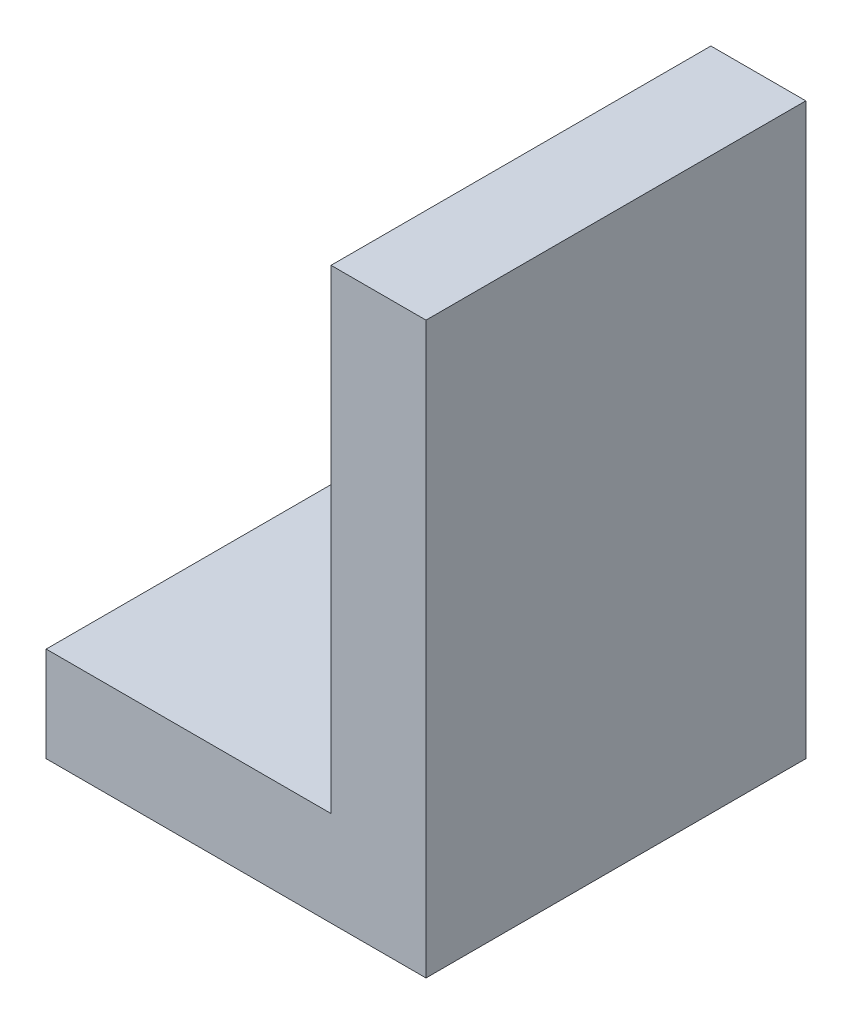
ISO-10303-21;
HEADER;
FILE_DESCRIPTION(('STEP AP214'),'2;1');
FILE_NAME('part.step','',(''),(''),'','','');
FILE_SCHEMA(('AUTOMOTIVE_DESIGN { 1 0 10303 214 1 1 1 1 }'));
ENDSEC;
DATA;
#1=APPLICATION_CONTEXT('core data for automotive mechanical design processes');
#2=APPLICATION_PROTOCOL_DEFINITION('international standard','automotive_design',2000,#1);
#3=PRODUCT_CONTEXT('',#1,'mechanical');
#4=PRODUCT('Part','Part','',(#3));
#5=PRODUCT_RELATED_PRODUCT_CATEGORY('part','',(#4));
#6=PRODUCT_DEFINITION_FORMATION('','',#4);
#7=PRODUCT_DEFINITION_CONTEXT('part definition',#1,'design');
#8=PRODUCT_DEFINITION('design','',#6,#7);
#9=PRODUCT_DEFINITION_SHAPE('','',#8);
#10=(LENGTH_UNIT() NAMED_UNIT(*) SI_UNIT(.MILLI.,.METRE.));
#11=(NAMED_UNIT(*) PLANE_ANGLE_UNIT() SI_UNIT($,.RADIAN.));
#12=(NAMED_UNIT(*) SI_UNIT($,.STERADIAN.) SOLID_ANGLE_UNIT());
#13=UNCERTAINTY_MEASURE_WITH_UNIT(LENGTH_MEASURE(1.E-05),#10,'distance_accuracy_value','');
#14=(GEOMETRIC_REPRESENTATION_CONTEXT(3) GLOBAL_UNCERTAINTY_ASSIGNED_CONTEXT((#13)) GLOBAL_UNIT_ASSIGNED_CONTEXT((#10,
#11,#12)) REPRESENTATION_CONTEXT('',''));
#15=CARTESIAN_POINT('',(0.,0.,0.));
#16=DIRECTION('',(0.,0.,1.));
#17=DIRECTION('',(1.,0.,0.));
#18=AXIS2_PLACEMENT_3D('',#15,#16,#17);
#19=CARTESIAN_POINT('',(0.,10.,0.));
#20=DIRECTION('',(0.,-1.,0.));
#21=DIRECTION('',(0.,0.,-1.));
#22=AXIS2_PLACEMENT_3D('',#19,#20,#21);
#23=PLANE('',#22);
#24=DIRECTION('',(0.,0.,1.));
#25=VECTOR('',#24,1.);
#26=CARTESIAN_POINT('',(-1.64556962025316,10.,-5.72151898734177));
#27=LINE('',#26,#25);
#28=CARTESIAN_POINT('',(-1.64556962025316,10.,-5.72151898734177));
#29=VERTEX_POINT('',#28);
#30=CARTESIAN_POINT('',(-1.64556962025316,10.,34.2784810126582));
#31=VERTEX_POINT('',#30);
#32=EDGE_CURVE('E52',#29,#31,#27,.T.);
#33=ORIENTED_EDGE('',*,*,#32,.F.);
#34=DIRECTION('',(-1.,0.,0.));
#35=VECTOR('',#34,1.);
#36=CARTESIAN_POINT('',(8.35443037974684,10.,-5.72151898734177));
#37=LINE('',#36,#35);
#38=CARTESIAN_POINT('',(-31.6455696202532,10.,-5.72151898734177));
#39=VERTEX_POINT('',#38);
#40=EDGE_CURVE('E89',#29,#39,#37,.T.);
#41=ORIENTED_EDGE('',*,*,#40,.T.);
#42=DIRECTION('',(0.,0.,1.));
#43=VECTOR('',#42,1.);
#44=CARTESIAN_POINT('',(-31.6455696202532,10.,-5.72151898734177));
#45=LINE('',#44,#43);
#46=CARTESIAN_POINT('',(-31.6455696202532,10.,34.2784810126582));
#47=VERTEX_POINT('',#46);
#48=EDGE_CURVE('E58',#39,#47,#45,.T.);
#49=ORIENTED_EDGE('',*,*,#48,.T.);
#50=DIRECTION('',(1.,0.,0.));
#51=VECTOR('',#50,1.);
#52=CARTESIAN_POINT('',(8.35443037974684,10.,34.2784810126582));
#53=LINE('',#52,#51);
#54=EDGE_CURVE('E99',#47,#31,#53,.T.);
#55=ORIENTED_EDGE('',*,*,#54,.T.);
#56=EDGE_LOOP('',(#33,#41,#49,#55));
#57=FACE_BOUND('',#56,.T.);
#58=ADVANCED_FACE('F37',(#57),#23,.F.);
#59=CARTESIAN_POINT('',(8.35443037974684,10.,-5.72151898734177));
#60=DIRECTION('',(-1.,0.,0.));
#61=DIRECTION('',(0.,0.,1.));
#62=AXIS2_PLACEMENT_3D('',#59,#60,#61);
#63=PLANE('',#62);
#64=DIRECTION('',(0.,0.,-1.));
#65=VECTOR('',#64,1.);
#66=CARTESIAN_POINT('',(8.35443037974684,0.,-5.72151898734177));
#67=LINE('',#66,#65);
#68=CARTESIAN_POINT('',(8.35443037974684,0.,34.2784810126582));
#69=VERTEX_POINT('',#68);
#70=CARTESIAN_POINT('',(8.35443037974684,0.,-5.72151898734177));
#71=VERTEX_POINT('',#70);
#72=EDGE_CURVE('E96',#69,#71,#67,.T.);
#73=ORIENTED_EDGE('',*,*,#72,.T.);
#74=DIRECTION('',(0.,-1.,0.));
#75=VECTOR('',#74,1.);
#76=CARTESIAN_POINT('',(8.35443037974684,10.,-5.72151898734177));
#77=LINE('',#76,#75);
#78=CARTESIAN_POINT('',(8.35443037974684,60.,-5.72151898734177));
#79=VERTEX_POINT('',#78);
#80=EDGE_CURVE('E11',#79,#71,#77,.T.);
#81=ORIENTED_EDGE('',*,*,#80,.F.);
#82=DIRECTION('',(0.,0.,-1.));
#83=VECTOR('',#82,1.);
#84=CARTESIAN_POINT('',(8.35443037974684,60.,-5.72151898734177));
#85=LINE('',#84,#83);
#86=CARTESIAN_POINT('',(8.35443037974684,60.,34.2784810126582));
#87=VERTEX_POINT('',#86);
#88=EDGE_CURVE('E98',#87,#79,#85,.T.);
#89=ORIENTED_EDGE('',*,*,#88,.F.);
#90=DIRECTION('',(0.,-1.,0.));
#91=VECTOR('',#90,1.);
#92=CARTESIAN_POINT('',(8.35443037974684,10.,34.2784810126582));
#93=LINE('',#92,#91);
#94=EDGE_CURVE('E82',#87,#69,#93,.T.);
#95=ORIENTED_EDGE('',*,*,#94,.T.);
#96=EDGE_LOOP('',(#73,#81,#89,#95));
#97=FACE_BOUND('',#96,.T.);
#98=ADVANCED_FACE('F39',(#97),#63,.F.);
#99=CARTESIAN_POINT('',(8.35443037974684,10.,-5.72151898734177));
#100=DIRECTION('',(0.,0.,1.));
#101=DIRECTION('',(1.,0.,0.));
#102=AXIS2_PLACEMENT_3D('',#99,#100,#101);
#103=PLANE('',#102);
#104=DIRECTION('',(-1.,0.,0.));
#105=VECTOR('',#104,1.);
#106=CARTESIAN_POINT('',(8.35443037974684,0.,-5.72151898734177));
#107=LINE('',#106,#105);
#108=CARTESIAN_POINT('',(-31.6455696202532,0.,-5.72151898734177));
#109=VERTEX_POINT('',#108);
#110=EDGE_CURVE('E102',#71,#109,#107,.T.);
#111=ORIENTED_EDGE('',*,*,#110,.T.);
#112=DIRECTION('',(0.,-1.,0.));
#113=VECTOR('',#112,1.);
#114=CARTESIAN_POINT('',(-31.6455696202532,10.,-5.72151898734177));
#115=LINE('',#114,#113);
#116=EDGE_CURVE('E45',#39,#109,#115,.T.);
#117=ORIENTED_EDGE('',*,*,#116,.F.);
#118=ORIENTED_EDGE('',*,*,#40,.F.);
#119=DIRECTION('',(0.,-1.,0.));
#120=VECTOR('',#119,1.);
#121=CARTESIAN_POINT('',(-1.64556962025316,60.,-5.72151898734177));
#122=LINE('',#121,#120);
#123=CARTESIAN_POINT('',(-1.64556962025316,60.,-5.72151898734177));
#124=VERTEX_POINT('',#123);
#125=EDGE_CURVE('E103',#124,#29,#122,.T.);
#126=ORIENTED_EDGE('',*,*,#125,.F.);
#127=DIRECTION('',(-1.,0.,0.));
#128=VECTOR('',#127,1.);
#129=CARTESIAN_POINT('',(8.35443037974684,60.,-5.72151898734177));
#130=LINE('',#129,#128);
#131=EDGE_CURVE('E123',#79,#124,#130,.T.);
#132=ORIENTED_EDGE('',*,*,#131,.F.);
#133=ORIENTED_EDGE('',*,*,#80,.T.);
#134=EDGE_LOOP('',(#111,#117,#118,#126,#132,#133));
#135=FACE_BOUND('',#134,.T.);
#136=ADVANCED_FACE('F118',(#135),#103,.F.);
#137=CARTESIAN_POINT('',(-31.6455696202532,10.,-5.72151898734177));
#138=DIRECTION('',(1.,0.,0.));
#139=DIRECTION('',(0.,0.,-1.));
#140=AXIS2_PLACEMENT_3D('',#137,#138,#139);
#141=PLANE('',#140);
#142=DIRECTION('',(0.,0.,1.));
#143=VECTOR('',#142,1.);
#144=CARTESIAN_POINT('',(-31.6455696202532,0.,-5.72151898734177));
#145=LINE('',#144,#143);
#146=CARTESIAN_POINT('',(-31.6455696202532,0.,34.2784810126582));
#147=VERTEX_POINT('',#146);
#148=EDGE_CURVE('E90',#109,#147,#145,.T.);
#149=ORIENTED_EDGE('',*,*,#148,.T.);
#150=DIRECTION('',(0.,-1.,0.));
#151=VECTOR('',#150,1.);
#152=CARTESIAN_POINT('',(-31.6455696202532,10.,34.2784810126582));
#153=LINE('',#152,#151);
#154=EDGE_CURVE('E85',#47,#147,#153,.T.);
#155=ORIENTED_EDGE('',*,*,#154,.F.);
#156=ORIENTED_EDGE('',*,*,#48,.F.);
#157=ORIENTED_EDGE('',*,*,#116,.T.);
#158=EDGE_LOOP('',(#149,#155,#156,#157));
#159=FACE_BOUND('',#158,.T.);
#160=ADVANCED_FACE('F116',(#159),#141,.F.);
#161=CARTESIAN_POINT('',(8.35443037974684,10.,34.2784810126582));
#162=DIRECTION('',(0.,0.,-1.));
#163=DIRECTION('',(-1.,0.,0.));
#164=AXIS2_PLACEMENT_3D('',#161,#162,#163);
#165=PLANE('',#164);
#166=DIRECTION('',(1.,0.,0.));
#167=VECTOR('',#166,1.);
#168=CARTESIAN_POINT('',(8.35443037974684,0.,34.2784810126582));
#169=LINE('',#168,#167);
#170=EDGE_CURVE('E78',#147,#69,#169,.T.);
#171=ORIENTED_EDGE('',*,*,#170,.T.);
#172=ORIENTED_EDGE('',*,*,#94,.F.);
#173=DIRECTION('',(1.,0.,0.));
#174=VECTOR('',#173,1.);
#175=CARTESIAN_POINT('',(8.35443037974684,60.,34.2784810126582));
#176=LINE('',#175,#174);
#177=CARTESIAN_POINT('',(-1.64556962025316,60.,34.2784810126582));
#178=VERTEX_POINT('',#177);
#179=EDGE_CURVE('E137',#178,#87,#176,.T.);
#180=ORIENTED_EDGE('',*,*,#179,.F.);
#181=DIRECTION('',(0.,-1.,0.));
#182=VECTOR('',#181,1.);
#183=CARTESIAN_POINT('',(-1.64556962025316,60.,34.2784810126582));
#184=LINE('',#183,#182);
#185=EDGE_CURVE('E107',#178,#31,#184,.T.);
#186=ORIENTED_EDGE('',*,*,#185,.T.);
#187=ORIENTED_EDGE('',*,*,#54,.F.);
#188=ORIENTED_EDGE('',*,*,#154,.T.);
#189=EDGE_LOOP('',(#171,#172,#180,#186,#187,#188));
#190=FACE_BOUND('',#189,.T.);
#191=ADVANCED_FACE('F80',(#190),#165,.F.);
#192=CARTESIAN_POINT('',(0.,0.,0.));
#193=DIRECTION('',(0.,-1.,0.));
#194=DIRECTION('',(0.,0.,-1.));
#195=AXIS2_PLACEMENT_3D('',#192,#193,#194);
#196=PLANE('',#195);
#197=ORIENTED_EDGE('',*,*,#72,.F.);
#198=ORIENTED_EDGE('',*,*,#170,.F.);
#199=ORIENTED_EDGE('',*,*,#148,.F.);
#200=ORIENTED_EDGE('',*,*,#110,.F.);
#201=EDGE_LOOP('',(#197,#198,#199,#200));
#202=FACE_BOUND('',#201,.T.);
#203=ADVANCED_FACE('F101',(#202),#196,.T.);
#204=CARTESIAN_POINT('',(-1.64556962025316,60.,-5.72151898734177));
#205=DIRECTION('',(1.,0.,0.));
#206=DIRECTION('',(0.,0.,-1.));
#207=AXIS2_PLACEMENT_3D('',#204,#205,#206);
#208=PLANE('',#207);
#209=ORIENTED_EDGE('',*,*,#32,.T.);
#210=ORIENTED_EDGE('',*,*,#185,.F.);
#211=DIRECTION('',(0.,0.,1.));
#212=VECTOR('',#211,1.);
#213=CARTESIAN_POINT('',(-1.64556962025316,60.,-5.72151898734177));
#214=LINE('',#213,#212);
#215=EDGE_CURVE('E134',#124,#178,#214,.T.);
#216=ORIENTED_EDGE('',*,*,#215,.F.);
#217=ORIENTED_EDGE('',*,*,#125,.T.);
#218=EDGE_LOOP('',(#209,#210,#216,#217));
#219=FACE_BOUND('',#218,.T.);
#220=ADVANCED_FACE('F141',(#219),#208,.F.);
#221=CARTESIAN_POINT('',(0.,60.,0.));
#222=DIRECTION('',(0.,-1.,0.));
#223=DIRECTION('',(0.,0.,-1.));
#224=AXIS2_PLACEMENT_3D('',#221,#222,#223);
#225=PLANE('',#224);
#226=ORIENTED_EDGE('',*,*,#88,.T.);
#227=ORIENTED_EDGE('',*,*,#131,.T.);
#228=ORIENTED_EDGE('',*,*,#215,.T.);
#229=ORIENTED_EDGE('',*,*,#179,.T.);
#230=EDGE_LOOP('',(#226,#227,#228,#229));
#231=FACE_BOUND('',#230,.T.);
#232=ADVANCED_FACE('F136',(#231),#225,.F.);
#233=CLOSED_SHELL('',(#58,#98,#136,#160,#191,#203,#220,#232));
#234=MANIFOLD_SOLID_BREP('B2',#233);
#235=ADVANCED_BREP_SHAPE_REPRESENTATION('',(#18,#234),#14);
#236=SHAPE_DEFINITION_REPRESENTATION(#9,#235);
ENDSEC;
END-ISO-10303-21;
